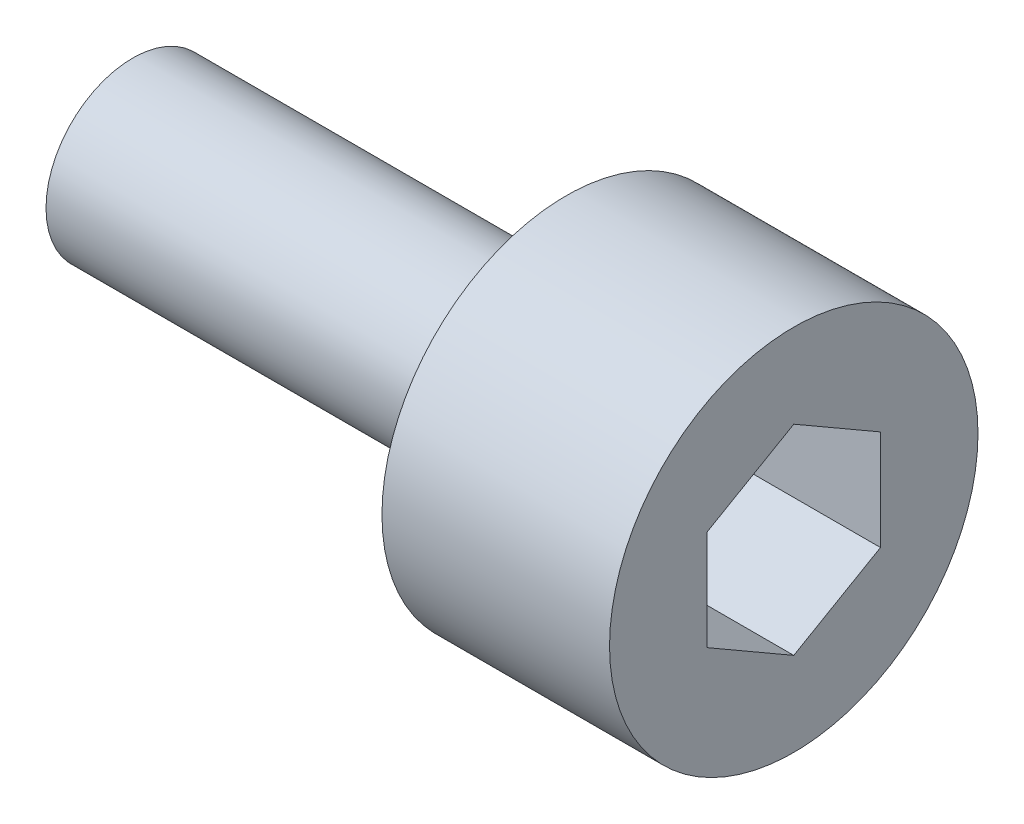
ISO-10303-21;
HEADER;
FILE_DESCRIPTION(('STEP AP214'),'2;1');
FILE_NAME('part.step','',(''),(''),'','','');
FILE_SCHEMA(('AUTOMOTIVE_DESIGN { 1 0 10303 214 1 1 1 1 }'));
ENDSEC;
DATA;
#1=APPLICATION_CONTEXT('core data for automotive mechanical design processes');
#2=APPLICATION_PROTOCOL_DEFINITION('international standard','automotive_design',2000,#1);
#3=PRODUCT_CONTEXT('',#1,'mechanical');
#4=PRODUCT('Part','Part','',(#3));
#5=PRODUCT_RELATED_PRODUCT_CATEGORY('part','',(#4));
#6=PRODUCT_DEFINITION_FORMATION('','',#4);
#7=PRODUCT_DEFINITION_CONTEXT('part definition',#1,'design');
#8=PRODUCT_DEFINITION('design','',#6,#7);
#9=PRODUCT_DEFINITION_SHAPE('','',#8);
#10=(LENGTH_UNIT() NAMED_UNIT(*) SI_UNIT(.MILLI.,.METRE.));
#11=(NAMED_UNIT(*) PLANE_ANGLE_UNIT() SI_UNIT($,.RADIAN.));
#12=(NAMED_UNIT(*) SI_UNIT($,.STERADIAN.) SOLID_ANGLE_UNIT());
#13=UNCERTAINTY_MEASURE_WITH_UNIT(LENGTH_MEASURE(1.E-05),#10,'distance_accuracy_value','');
#14=(GEOMETRIC_REPRESENTATION_CONTEXT(3) GLOBAL_UNCERTAINTY_ASSIGNED_CONTEXT((#13)) GLOBAL_UNIT_ASSIGNED_CONTEXT((#10,
#11,#12)) REPRESENTATION_CONTEXT('',''));
#15=CARTESIAN_POINT('',(0.,0.,0.));
#16=DIRECTION('',(0.,0.,1.));
#17=DIRECTION('',(1.,0.,0.));
#18=AXIS2_PLACEMENT_3D('',#15,#16,#17);
#19=CARTESIAN_POINT('',(5.25,0.,0.));
#20=DIRECTION('',(-1.,0.,0.));
#21=DIRECTION('',(0.,0.,1.));
#22=AXIS2_PLACEMENT_3D('',#19,#20,#21);
#23=CYLINDRICAL_SURFACE('',#22,4.25);
#24=CARTESIAN_POINT('',(5.25,0.,0.));
#25=DIRECTION('',(1.,0.,0.));
#26=DIRECTION('',(0.,0.,-1.));
#27=AXIS2_PLACEMENT_3D('',#24,#25,#26);
#28=CIRCLE('',#27,4.25);
#29=CARTESIAN_POINT('',(5.25,0.,-4.25));
#30=VERTEX_POINT('',#29);
#31=EDGE_CURVE('E45',#30,#30,#28,.T.);
#32=ORIENTED_EDGE('',*,*,#31,.F.);
#33=EDGE_LOOP('',(#32));
#34=FACE_BOUND('',#33,.T.);
#35=CARTESIAN_POINT('',(0.,0.,0.));
#36=DIRECTION('',(1.,0.,0.));
#37=DIRECTION('',(0.,0.,-1.));
#38=AXIS2_PLACEMENT_3D('',#35,#36,#37);
#39=CIRCLE('',#38,4.25);
#40=CARTESIAN_POINT('',(0.,0.,-4.25));
#41=VERTEX_POINT('',#40);
#42=EDGE_CURVE('E40',#41,#41,#39,.T.);
#43=ORIENTED_EDGE('',*,*,#42,.T.);
#44=EDGE_LOOP('',(#43));
#45=FACE_BOUND('',#44,.T.);
#46=ADVANCED_FACE('F37',(#34,#45),#23,.T.);
#47=CARTESIAN_POINT('',(5.25,0.,0.));
#48=DIRECTION('',(1.,0.,0.));
#49=DIRECTION('',(0.,0.,-1.));
#50=AXIS2_PLACEMENT_3D('',#47,#48,#49);
#51=PLANE('',#50);
#52=DIRECTION('',(0.,0.5,0.866025403784439));
#53=VECTOR('',#52,1.);
#54=CARTESIAN_POINT('',(5.25,1.15470053837925,-2.));
#55=LINE('',#54,#53);
#56=CARTESIAN_POINT('',(5.25,1.15470053837925,-2.));
#57=VERTEX_POINT('',#56);
#58=CARTESIAN_POINT('',(5.25,2.3094010767585,0.));
#59=VERTEX_POINT('',#58);
#60=EDGE_CURVE('E53',#57,#59,#55,.T.);
#61=ORIENTED_EDGE('',*,*,#60,.F.);
#62=DIRECTION('',(0.,1.,0.));
#63=VECTOR('',#62,1.);
#64=CARTESIAN_POINT('',(5.25,-1.15470053837925,-2.));
#65=LINE('',#64,#63);
#66=CARTESIAN_POINT('',(5.25,-1.15470053837925,-2.));
#67=VERTEX_POINT('',#66);
#68=EDGE_CURVE('E137',#67,#57,#65,.T.);
#69=ORIENTED_EDGE('',*,*,#68,.F.);
#70=DIRECTION('',(0.,0.5,-0.866025403784438));
#71=VECTOR('',#70,1.);
#72=CARTESIAN_POINT('',(5.25,-2.3094010767585,0.));
#73=LINE('',#72,#71);
#74=CARTESIAN_POINT('',(5.25,-2.3094010767585,0.));
#75=VERTEX_POINT('',#74);
#76=EDGE_CURVE('E135',#75,#67,#73,.T.);
#77=ORIENTED_EDGE('',*,*,#76,.F.);
#78=DIRECTION('',(0.,-0.5,-0.866025403784438));
#79=VECTOR('',#78,1.);
#80=CARTESIAN_POINT('',(5.25,-1.15470053837925,2.));
#81=LINE('',#80,#79);
#82=CARTESIAN_POINT('',(5.25,-1.15470053837925,2.));
#83=VERTEX_POINT('',#82);
#84=EDGE_CURVE('E101',#83,#75,#81,.T.);
#85=ORIENTED_EDGE('',*,*,#84,.F.);
#86=DIRECTION('',(0.,-1.,0.));
#87=VECTOR('',#86,1.);
#88=CARTESIAN_POINT('',(5.25,1.15470053837925,2.));
#89=LINE('',#88,#87);
#90=CARTESIAN_POINT('',(5.25,1.15470053837925,2.));
#91=VERTEX_POINT('',#90);
#92=EDGE_CURVE('E131',#91,#83,#89,.T.);
#93=ORIENTED_EDGE('',*,*,#92,.F.);
#94=DIRECTION('',(0.,-0.5,0.866025403784439));
#95=VECTOR('',#94,1.);
#96=CARTESIAN_POINT('',(5.25,2.3094010767585,0.));
#97=LINE('',#96,#95);
#98=EDGE_CURVE('E127',#59,#91,#97,.T.);
#99=ORIENTED_EDGE('',*,*,#98,.F.);
#100=EDGE_LOOP('',(#61,#69,#77,#85,#93,#99));
#101=FACE_BOUND('',#100,.T.);
#102=ORIENTED_EDGE('',*,*,#31,.T.);
#103=EDGE_LOOP('',(#102));
#104=FACE_BOUND('',#103,.T.);
#105=ADVANCED_FACE('F155',(#101,#104),#51,.T.);
#106=CARTESIAN_POINT('',(0.,0.,0.));
#107=DIRECTION('',(1.,0.,0.));
#108=DIRECTION('',(0.,0.,-1.));
#109=AXIS2_PLACEMENT_3D('',#106,#107,#108);
#110=PLANE('',#109);
#111=CARTESIAN_POINT('',(0.,0.,0.));
#112=DIRECTION('',(-1.,0.,0.));
#113=DIRECTION('',(0.,0.,1.));
#114=AXIS2_PLACEMENT_3D('',#111,#112,#113);
#115=CIRCLE('',#114,2.);
#116=CARTESIAN_POINT('',(0.,0.,2.));
#117=VERTEX_POINT('',#116);
#118=EDGE_CURVE('E11',#117,#117,#115,.T.);
#119=ORIENTED_EDGE('',*,*,#118,.F.);
#120=EDGE_LOOP('',(#119));
#121=FACE_BOUND('',#120,.T.);
#122=ORIENTED_EDGE('',*,*,#42,.F.);
#123=EDGE_LOOP('',(#122));
#124=FACE_BOUND('',#123,.T.);
#125=ADVANCED_FACE('F152',(#121,#124),#110,.F.);
#126=CARTESIAN_POINT('',(1.65,1.15470053837925,-2.));
#127=DIRECTION('',(0.,0.866025403784439,-0.5));
#128=DIRECTION('',(0.,0.5,0.866025403784439));
#129=AXIS2_PLACEMENT_3D('',#126,#127,#128);
#130=PLANE('',#129);
#131=ORIENTED_EDGE('',*,*,#60,.T.);
#132=DIRECTION('',(1.,0.,0.));
#133=VECTOR('',#132,1.);
#134=CARTESIAN_POINT('',(1.65,2.3094010767585,0.));
#135=LINE('',#134,#133);
#136=CARTESIAN_POINT('',(1.65,2.3094010767585,0.));
#137=VERTEX_POINT('',#136);
#138=EDGE_CURVE('E83',#137,#59,#135,.T.);
#139=ORIENTED_EDGE('',*,*,#138,.F.);
#140=DIRECTION('',(0.,0.5,0.866025403784439));
#141=VECTOR('',#140,1.);
#142=CARTESIAN_POINT('',(1.65,1.15470053837925,-2.));
#143=LINE('',#142,#141);
#144=CARTESIAN_POINT('',(1.65,1.15470053837925,-2.));
#145=VERTEX_POINT('',#144);
#146=EDGE_CURVE('E139',#145,#137,#143,.T.);
#147=ORIENTED_EDGE('',*,*,#146,.F.);
#148=DIRECTION('',(1.,0.,0.));
#149=VECTOR('',#148,1.);
#150=CARTESIAN_POINT('',(1.65,1.15470053837925,-2.));
#151=LINE('',#150,#149);
#152=EDGE_CURVE('E61',#145,#57,#151,.T.);
#153=ORIENTED_EDGE('',*,*,#152,.T.);
#154=EDGE_LOOP('',(#131,#139,#147,#153));
#155=FACE_BOUND('',#154,.T.);
#156=ADVANCED_FACE('F154',(#155),#130,.F.);
#157=CARTESIAN_POINT('',(1.65,-1.15470053837925,-2.));
#158=DIRECTION('',(0.,0.,-1.));
#159=DIRECTION('',(-1.,0.,0.));
#160=AXIS2_PLACEMENT_3D('',#157,#158,#159);
#161=PLANE('',#160);
#162=ORIENTED_EDGE('',*,*,#68,.T.);
#163=ORIENTED_EDGE('',*,*,#152,.F.);
#164=DIRECTION('',(0.,1.,0.));
#165=VECTOR('',#164,1.);
#166=CARTESIAN_POINT('',(1.65,-1.15470053837925,-2.));
#167=LINE('',#166,#165);
#168=CARTESIAN_POINT('',(1.65,-1.15470053837925,-2.));
#169=VERTEX_POINT('',#168);
#170=EDGE_CURVE('E113',#169,#145,#167,.T.);
#171=ORIENTED_EDGE('',*,*,#170,.F.);
#172=DIRECTION('',(1.,0.,0.));
#173=VECTOR('',#172,1.);
#174=CARTESIAN_POINT('',(1.65,-1.15470053837925,-2.));
#175=LINE('',#174,#173);
#176=EDGE_CURVE('E105',#169,#67,#175,.T.);
#177=ORIENTED_EDGE('',*,*,#176,.T.);
#178=EDGE_LOOP('',(#162,#163,#171,#177));
#179=FACE_BOUND('',#178,.T.);
#180=ADVANCED_FACE('F161',(#179),#161,.F.);
#181=CARTESIAN_POINT('',(1.65,-2.3094010767585,0.));
#182=DIRECTION('',(0.,-0.866025403784439,-0.5));
#183=DIRECTION('',(0.,0.5,-0.866025403784439));
#184=AXIS2_PLACEMENT_3D('',#181,#182,#183);
#185=PLANE('',#184);
#186=ORIENTED_EDGE('',*,*,#76,.T.);
#187=ORIENTED_EDGE('',*,*,#176,.F.);
#188=DIRECTION('',(0.,0.5,-0.866025403784438));
#189=VECTOR('',#188,1.);
#190=CARTESIAN_POINT('',(1.65,-2.3094010767585,0.));
#191=LINE('',#190,#189);
#192=CARTESIAN_POINT('',(1.65,-2.3094010767585,0.));
#193=VERTEX_POINT('',#192);
#194=EDGE_CURVE('E109',#193,#169,#191,.T.);
#195=ORIENTED_EDGE('',*,*,#194,.F.);
#196=DIRECTION('',(1.,0.,0.));
#197=VECTOR('',#196,1.);
#198=CARTESIAN_POINT('',(1.65,-2.3094010767585,0.));
#199=LINE('',#198,#197);
#200=EDGE_CURVE('E94',#193,#75,#199,.T.);
#201=ORIENTED_EDGE('',*,*,#200,.T.);
#202=EDGE_LOOP('',(#186,#187,#195,#201));
#203=FACE_BOUND('',#202,.T.);
#204=ADVANCED_FACE('F110',(#203),#185,.F.);
#205=CARTESIAN_POINT('',(1.65,-1.15470053837925,2.));
#206=DIRECTION('',(0.,-0.866025403784439,0.5));
#207=DIRECTION('',(0.,-0.5,-0.866025403784439));
#208=AXIS2_PLACEMENT_3D('',#205,#206,#207);
#209=PLANE('',#208);
#210=ORIENTED_EDGE('',*,*,#84,.T.);
#211=ORIENTED_EDGE('',*,*,#200,.F.);
#212=DIRECTION('',(0.,-0.5,-0.866025403784438));
#213=VECTOR('',#212,1.);
#214=CARTESIAN_POINT('',(1.65,-1.15470053837925,2.));
#215=LINE('',#214,#213);
#216=CARTESIAN_POINT('',(1.65,-1.15470053837925,2.));
#217=VERTEX_POINT('',#216);
#218=EDGE_CURVE('E98',#217,#193,#215,.T.);
#219=ORIENTED_EDGE('',*,*,#218,.F.);
#220=DIRECTION('',(1.,0.,0.));
#221=VECTOR('',#220,1.);
#222=CARTESIAN_POINT('',(1.65,-1.15470053837925,2.));
#223=LINE('',#222,#221);
#224=EDGE_CURVE('E106',#217,#83,#223,.T.);
#225=ORIENTED_EDGE('',*,*,#224,.T.);
#226=EDGE_LOOP('',(#210,#211,#219,#225));
#227=FACE_BOUND('',#226,.T.);
#228=ADVANCED_FACE('F96',(#227),#209,.F.);
#229=CARTESIAN_POINT('',(1.65,1.15470053837925,2.));
#230=DIRECTION('',(0.,0.,1.));
#231=DIRECTION('',(1.,0.,0.));
#232=AXIS2_PLACEMENT_3D('',#229,#230,#231);
#233=PLANE('',#232);
#234=ORIENTED_EDGE('',*,*,#92,.T.);
#235=ORIENTED_EDGE('',*,*,#224,.F.);
#236=DIRECTION('',(0.,-1.,0.));
#237=VECTOR('',#236,1.);
#238=CARTESIAN_POINT('',(1.65,1.15470053837925,2.));
#239=LINE('',#238,#237);
#240=CARTESIAN_POINT('',(1.65,1.15470053837925,2.));
#241=VERTEX_POINT('',#240);
#242=EDGE_CURVE('E119',#241,#217,#239,.T.);
#243=ORIENTED_EDGE('',*,*,#242,.F.);
#244=DIRECTION('',(1.,0.,0.));
#245=VECTOR('',#244,1.);
#246=CARTESIAN_POINT('',(1.65,1.15470053837925,2.));
#247=LINE('',#246,#245);
#248=EDGE_CURVE('E143',#241,#91,#247,.T.);
#249=ORIENTED_EDGE('',*,*,#248,.T.);
#250=EDGE_LOOP('',(#234,#235,#243,#249));
#251=FACE_BOUND('',#250,.T.);
#252=ADVANCED_FACE('F210',(#251),#233,.F.);
#253=CARTESIAN_POINT('',(1.65,2.3094010767585,0.));
#254=DIRECTION('',(0.,0.866025403784439,0.5));
#255=DIRECTION('',(0.,-0.5,0.866025403784439));
#256=AXIS2_PLACEMENT_3D('',#253,#254,#255);
#257=PLANE('',#256);
#258=ORIENTED_EDGE('',*,*,#98,.T.);
#259=ORIENTED_EDGE('',*,*,#248,.F.);
#260=DIRECTION('',(0.,-0.5,0.866025403784439));
#261=VECTOR('',#260,1.);
#262=CARTESIAN_POINT('',(1.65,2.3094010767585,0.));
#263=LINE('',#262,#261);
#264=EDGE_CURVE('E121',#137,#241,#263,.T.);
#265=ORIENTED_EDGE('',*,*,#264,.F.);
#266=ORIENTED_EDGE('',*,*,#138,.T.);
#267=EDGE_LOOP('',(#258,#259,#265,#266));
#268=FACE_BOUND('',#267,.T.);
#269=ADVANCED_FACE('F220',(#268),#257,.F.);
#270=CARTESIAN_POINT('',(1.65,0.,0.));
#271=DIRECTION('',(1.,0.,0.));
#272=DIRECTION('',(0.,0.,-1.));
#273=AXIS2_PLACEMENT_3D('',#270,#271,#272);
#274=PLANE('',#273);
#275=ORIENTED_EDGE('',*,*,#146,.T.);
#276=ORIENTED_EDGE('',*,*,#264,.T.);
#277=ORIENTED_EDGE('',*,*,#242,.T.);
#278=ORIENTED_EDGE('',*,*,#218,.T.);
#279=ORIENTED_EDGE('',*,*,#194,.T.);
#280=ORIENTED_EDGE('',*,*,#170,.T.);
#281=EDGE_LOOP('',(#275,#276,#277,#278,#279,#280));
#282=FACE_BOUND('',#281,.T.);
#283=ADVANCED_FACE('F116',(#282),#274,.T.);
#284=CARTESIAN_POINT('',(-10.,0.,0.));
#285=DIRECTION('',(1.,0.,0.));
#286=DIRECTION('',(0.,0.,-1.));
#287=AXIS2_PLACEMENT_3D('',#284,#285,#286);
#288=CYLINDRICAL_SURFACE('',#287,2.);
#289=CARTESIAN_POINT('',(-10.,0.,0.));
#290=DIRECTION('',(-1.,0.,0.));
#291=DIRECTION('',(0.,0.,1.));
#292=AXIS2_PLACEMENT_3D('',#289,#290,#291);
#293=CIRCLE('',#292,2.);
#294=CARTESIAN_POINT('',(-10.,0.,2.));
#295=VERTEX_POINT('',#294);
#296=EDGE_CURVE('E128',#295,#295,#293,.T.);
#297=ORIENTED_EDGE('',*,*,#296,.F.);
#298=EDGE_LOOP('',(#297));
#299=FACE_BOUND('',#298,.T.);
#300=ORIENTED_EDGE('',*,*,#118,.T.);
#301=EDGE_LOOP('',(#300));
#302=FACE_BOUND('',#301,.T.);
#303=ADVANCED_FACE('F240',(#299,#302),#288,.T.);
#304=CARTESIAN_POINT('',(-10.,0.,0.));
#305=DIRECTION('',(-1.,0.,0.));
#306=DIRECTION('',(0.,0.,1.));
#307=AXIS2_PLACEMENT_3D('',#304,#305,#306);
#308=PLANE('',#307);
#309=ORIENTED_EDGE('',*,*,#296,.T.);
#310=EDGE_LOOP('',(#309));
#311=FACE_BOUND('',#310,.T.);
#312=ADVANCED_FACE('F255',(#311),#308,.T.);
#313=CLOSED_SHELL('',(#46,#105,#125,#156,#180,#204,#228,#252,#269,#283,#303,#312));
#314=MANIFOLD_SOLID_BREP('B2',#313);
#315=ADVANCED_BREP_SHAPE_REPRESENTATION('',(#18,#314),#14);
#316=SHAPE_DEFINITION_REPRESENTATION(#9,#315);
ENDSEC;
END-ISO-10303-21;
